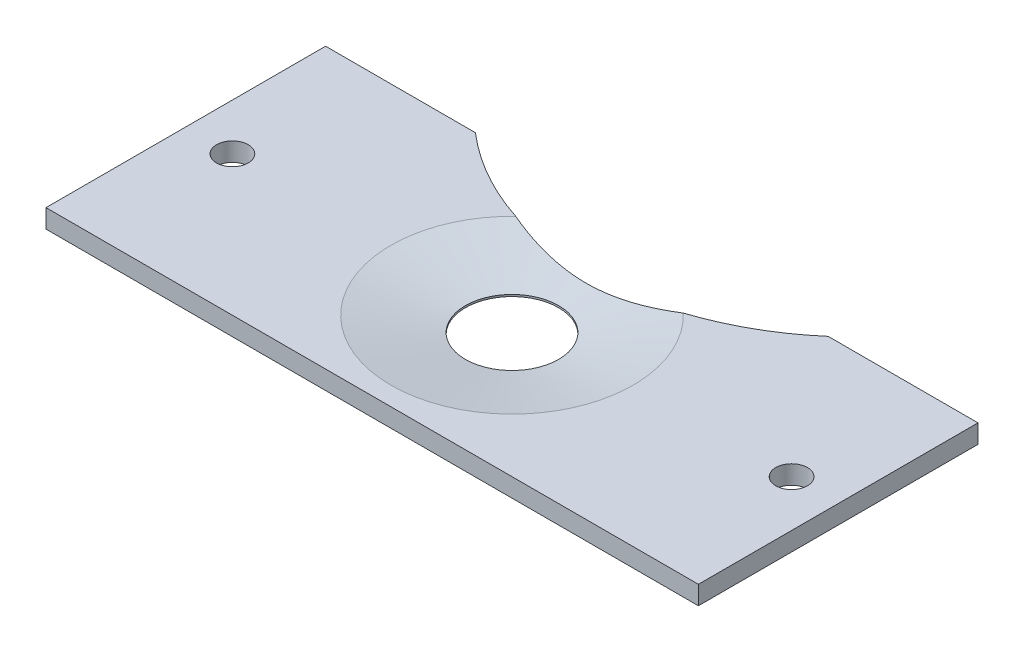
ISO-10303-21;
HEADER;
FILE_DESCRIPTION(('STEP AP214'),'2;1');
FILE_NAME('part.step','',(''),(''),'','','');
FILE_SCHEMA(('AUTOMOTIVE_DESIGN { 1 0 10303 214 1 1 1 1 }'));
ENDSEC;
DATA;
#1=APPLICATION_CONTEXT('core data for automotive mechanical design processes');
#2=APPLICATION_PROTOCOL_DEFINITION('international standard','automotive_design',2000,#1);
#3=PRODUCT_CONTEXT('',#1,'mechanical');
#4=PRODUCT('Part','Part','',(#3));
#5=PRODUCT_RELATED_PRODUCT_CATEGORY('part','',(#4));
#6=PRODUCT_DEFINITION_FORMATION('','',#4);
#7=PRODUCT_DEFINITION_CONTEXT('part definition',#1,'design');
#8=PRODUCT_DEFINITION('design','',#6,#7);
#9=PRODUCT_DEFINITION_SHAPE('','',#8);
#10=(LENGTH_UNIT() NAMED_UNIT(*) SI_UNIT(.MILLI.,.METRE.));
#11=(NAMED_UNIT(*) PLANE_ANGLE_UNIT() SI_UNIT($,.RADIAN.));
#12=(NAMED_UNIT(*) SI_UNIT($,.STERADIAN.) SOLID_ANGLE_UNIT());
#13=UNCERTAINTY_MEASURE_WITH_UNIT(LENGTH_MEASURE(1.E-05),#10,'distance_accuracy_value','');
#14=(GEOMETRIC_REPRESENTATION_CONTEXT(3) GLOBAL_UNCERTAINTY_ASSIGNED_CONTEXT((#13)) GLOBAL_UNIT_ASSIGNED_CONTEXT((#10,
#11,#12)) REPRESENTATION_CONTEXT('',''));
#15=CARTESIAN_POINT('',(0.,0.,0.));
#16=DIRECTION('',(0.,0.,1.));
#17=DIRECTION('',(1.,0.,0.));
#18=AXIS2_PLACEMENT_3D('',#15,#16,#17);
#19=CARTESIAN_POINT('',(-35.,2.,-15.));
#20=DIRECTION('',(0.,0.,1.));
#21=DIRECTION('',(1.,0.,0.));
#22=AXIS2_PLACEMENT_3D('',#19,#20,#21);
#23=PLANE('',#22);
#24=DIRECTION('',(-1.,0.,0.));
#25=VECTOR('',#24,1.);
#26=CARTESIAN_POINT('',(-35.,0.,-15.));
#27=LINE('',#26,#25);
#28=CARTESIAN_POINT('',(35.,0.,-15.));
#29=VERTEX_POINT('',#28);
#30=CARTESIAN_POINT('',(18.9251595149534,0.,-15.));
#31=VERTEX_POINT('',#30);
#32=EDGE_CURVE('E138',#29,#31,#27,.T.);
#33=ORIENTED_EDGE('',*,*,#32,.T.);
#34=DIRECTION('',(0.,1.,0.));
#35=VECTOR('',#34,1.);
#36=CARTESIAN_POINT('',(18.9251595149534,0.,-15.));
#37=LINE('',#36,#35);
#38=CARTESIAN_POINT('',(18.9251595149534,2.,-15.));
#39=VERTEX_POINT('',#38);
#40=EDGE_CURVE('E175',#31,#39,#37,.T.);
#41=ORIENTED_EDGE('',*,*,#40,.T.);
#42=DIRECTION('',(-1.,0.,0.));
#43=VECTOR('',#42,1.);
#44=CARTESIAN_POINT('',(-35.,2.,-15.));
#45=LINE('',#44,#43);
#46=CARTESIAN_POINT('',(35.,2.,-15.));
#47=VERTEX_POINT('',#46);
#48=EDGE_CURVE('E104',#47,#39,#45,.T.);
#49=ORIENTED_EDGE('',*,*,#48,.F.);
#50=DIRECTION('',(0.,-1.,0.));
#51=VECTOR('',#50,1.);
#52=CARTESIAN_POINT('',(35.,2.,-15.));
#53=LINE('',#52,#51);
#54=EDGE_CURVE('E151',#47,#29,#53,.T.);
#55=ORIENTED_EDGE('',*,*,#54,.T.);
#56=EDGE_LOOP('',(#33,#41,#49,#55));
#57=FACE_BOUND('',#56,.T.);
#58=ADVANCED_FACE('F32',(#57),#23,.F.);
#59=CARTESIAN_POINT('',(0.,2.,0.));
#60=DIRECTION('',(0.,-1.,0.));
#61=DIRECTION('',(0.,0.,-1.));
#62=AXIS2_PLACEMENT_3D('',#59,#60,#61);
#63=CYLINDRICAL_SURFACE('',#62,5.);
#64=CARTESIAN_POINT('',(0.,0.399999999999999,0.));
#65=DIRECTION('',(0.,1.,0.));
#66=DIRECTION('',(0.,0.,1.));
#67=AXIS2_PLACEMENT_3D('',#64,#65,#66);
#68=CIRCLE('',#67,5.);
#69=CARTESIAN_POINT('',(0.,0.399999999999999,5.));
#70=VERTEX_POINT('',#69);
#71=EDGE_CURVE('E109',#70,#70,#68,.T.);
#72=ORIENTED_EDGE('',*,*,#71,.T.);
#73=EDGE_LOOP('',(#72));
#74=FACE_BOUND('',#73,.T.);
#75=CARTESIAN_POINT('',(0.,0.2,0.));
#76=DIRECTION('',(0.,-1.,0.));
#77=DIRECTION('',(0.,0.,-1.));
#78=AXIS2_PLACEMENT_3D('',#75,#76,#77);
#79=CIRCLE('',#78,5.);
#80=CARTESIAN_POINT('',(0.,0.2,-5.));
#81=VERTEX_POINT('',#80);
#82=EDGE_CURVE('E115',#81,#81,#79,.T.);
#83=ORIENTED_EDGE('',*,*,#82,.T.);
#84=EDGE_LOOP('',(#83));
#85=FACE_BOUND('',#84,.T.);
#86=ADVANCED_FACE('F204',(#74,#85),#63,.F.);
#87=CARTESIAN_POINT('',(-35.,2.,15.));
#88=DIRECTION('',(0.,1.,0.));
#89=DIRECTION('',(0.,0.,1.));
#90=AXIS2_PLACEMENT_3D('',#87,#88,#89);
#91=PLANE('',#90);
#92=CARTESIAN_POINT('',(0.,2.,-36.9329032395456));
#93=DIRECTION('',(0.,1.,0.));
#94=DIRECTION('',(0.,0.,1.));
#95=AXIS2_PLACEMENT_3D('',#92,#93,#94);
#96=CIRCLE('',#95,28.9691889286135);
#97=CARTESIAN_POINT('',(8.98724404355307,2.,-9.39305299152641));
#98=VERTEX_POINT('',#97);
#99=EDGE_CURVE('E95',#98,#39,#96,.T.);
#100=ORIENTED_EDGE('',*,*,#99,.F.);
#101=CARTESIAN_POINT('',(0.,2.,0.));
#102=DIRECTION('',(0.,1.,0.));
#103=DIRECTION('',(0.,0.,1.));
#104=AXIS2_PLACEMENT_3D('',#101,#102,#103);
#105=CIRCLE('',#104,13.0000000000001);
#106=CARTESIAN_POINT('',(-8.98724404355307,2.,-9.39305299152641));
#107=VERTEX_POINT('',#106);
#108=EDGE_CURVE('E45',#98,#107,#105,.F.);
#109=ORIENTED_EDGE('',*,*,#108,.T.);
#110=CARTESIAN_POINT('',(-18.9251595149534,2.,-15.));
#111=VERTEX_POINT('',#110);
#112=EDGE_CURVE('E51',#111,#107,#96,.T.);
#113=ORIENTED_EDGE('',*,*,#112,.F.);
#114=CARTESIAN_POINT('',(-35.,2.,-15.));
#115=VERTEX_POINT('',#114);
#116=EDGE_CURVE('E58',#111,#115,#45,.T.);
#117=ORIENTED_EDGE('',*,*,#116,.T.);
#118=DIRECTION('',(0.,0.,1.));
#119=VECTOR('',#118,1.);
#120=CARTESIAN_POINT('',(-35.,2.,-15.));
#121=LINE('',#120,#119);
#122=CARTESIAN_POINT('',(-35.,2.,15.));
#123=VERTEX_POINT('',#122);
#124=EDGE_CURVE('E141',#115,#123,#121,.T.);
#125=ORIENTED_EDGE('',*,*,#124,.T.);
#126=DIRECTION('',(1.,0.,0.));
#127=VECTOR('',#126,1.);
#128=CARTESIAN_POINT('',(-35.,2.,15.));
#129=LINE('',#128,#127);
#130=CARTESIAN_POINT('',(35.,2.,15.));
#131=VERTEX_POINT('',#130);
#132=EDGE_CURVE('E143',#123,#131,#129,.T.);
#133=ORIENTED_EDGE('',*,*,#132,.T.);
#134=DIRECTION('',(0.,0.,-1.));
#135=VECTOR('',#134,1.);
#136=CARTESIAN_POINT('',(35.,2.,-15.));
#137=LINE('',#136,#135);
#138=EDGE_CURVE('E145',#131,#47,#137,.T.);
#139=ORIENTED_EDGE('',*,*,#138,.T.);
#140=ORIENTED_EDGE('',*,*,#48,.T.);
#141=EDGE_LOOP('',(#100,#109,#113,#117,#125,#133,#139,#140));
#142=FACE_BOUND('',#141,.T.);
#143=CARTESIAN_POINT('',(30.,2.,0.));
#144=DIRECTION('',(0.,1.,0.));
#145=DIRECTION('',(0.,0.,1.));
#146=AXIS2_PLACEMENT_3D('',#143,#144,#145);
#147=CIRCLE('',#146,1.69999999999999);
#148=CARTESIAN_POINT('',(30.,2.,1.69999999999999));
#149=VERTEX_POINT('',#148);
#150=EDGE_CURVE('E176',#149,#149,#147,.T.);
#151=ORIENTED_EDGE('',*,*,#150,.F.);
#152=EDGE_LOOP('',(#151));
#153=FACE_BOUND('',#152,.T.);
#154=CARTESIAN_POINT('',(-30.,2.,0.));
#155=DIRECTION('',(0.,1.,0.));
#156=DIRECTION('',(0.,0.,1.));
#157=AXIS2_PLACEMENT_3D('',#154,#155,#156);
#158=CIRCLE('',#157,1.69999999999999);
#159=CARTESIAN_POINT('',(-30.,2.,1.69999999999999));
#160=VERTEX_POINT('',#159);
#161=EDGE_CURVE('E188',#160,#160,#158,.T.);
#162=ORIENTED_EDGE('',*,*,#161,.F.);
#163=EDGE_LOOP('',(#162));
#164=FACE_BOUND('',#163,.T.);
#165=ADVANCED_FACE('F101',(#142,#153,#164),#91,.T.);
#166=CARTESIAN_POINT('',(-35.,0.,15.));
#167=DIRECTION('',(0.,1.,0.));
#168=DIRECTION('',(0.,0.,1.));
#169=AXIS2_PLACEMENT_3D('',#166,#167,#168);
#170=PLANE('',#169);
#171=CARTESIAN_POINT('',(30.,0.,0.));
#172=DIRECTION('',(0.,1.,0.));
#173=DIRECTION('',(0.,0.,1.));
#174=AXIS2_PLACEMENT_3D('',#171,#172,#173);
#175=CIRCLE('',#174,1.7);
#176=CARTESIAN_POINT('',(30.,0.,1.7));
#177=VERTEX_POINT('',#176);
#178=EDGE_CURVE('E180',#177,#177,#175,.T.);
#179=ORIENTED_EDGE('',*,*,#178,.T.);
#180=EDGE_LOOP('',(#179));
#181=FACE_BOUND('',#180,.T.);
#182=CARTESIAN_POINT('',(-30.,0.,0.));
#183=DIRECTION('',(0.,1.,0.));
#184=DIRECTION('',(0.,0.,1.));
#185=AXIS2_PLACEMENT_3D('',#182,#183,#184);
#186=CIRCLE('',#185,1.7);
#187=CARTESIAN_POINT('',(-30.,0.,1.7));
#188=VERTEX_POINT('',#187);
#189=EDGE_CURVE('E130',#188,#188,#186,.T.);
#190=ORIENTED_EDGE('',*,*,#189,.T.);
#191=EDGE_LOOP('',(#190));
#192=FACE_BOUND('',#191,.T.);
#193=CARTESIAN_POINT('',(0.,0.,0.));
#194=DIRECTION('',(0.,-1.,0.));
#195=DIRECTION('',(0.,0.,-1.));
#196=AXIS2_PLACEMENT_3D('',#193,#194,#195);
#197=CIRCLE('',#196,5.5);
#198=CARTESIAN_POINT('',(0.,0.,-5.5));
#199=VERTEX_POINT('',#198);
#200=EDGE_CURVE('E125',#199,#199,#197,.T.);
#201=ORIENTED_EDGE('',*,*,#200,.F.);
#202=EDGE_LOOP('',(#201));
#203=FACE_BOUND('',#202,.T.);
#204=CARTESIAN_POINT('',(-18.9251595149534,0.,-15.));
#205=VERTEX_POINT('',#204);
#206=CARTESIAN_POINT('',(-35.,0.,-15.));
#207=VERTEX_POINT('',#206);
#208=EDGE_CURVE('E137',#205,#207,#27,.T.);
#209=ORIENTED_EDGE('',*,*,#208,.F.);
#210=CARTESIAN_POINT('',(0.,0.,-36.9329032395456));
#211=DIRECTION('',(0.,1.,0.));
#212=DIRECTION('',(0.,0.,1.));
#213=AXIS2_PLACEMENT_3D('',#210,#211,#212);
#214=CIRCLE('',#213,28.9691889286135);
#215=EDGE_CURVE('E105',#205,#31,#214,.T.);
#216=ORIENTED_EDGE('',*,*,#215,.T.);
#217=ORIENTED_EDGE('',*,*,#32,.F.);
#218=DIRECTION('',(0.,0.,-1.));
#219=VECTOR('',#218,1.);
#220=CARTESIAN_POINT('',(35.,0.,-15.));
#221=LINE('',#220,#219);
#222=CARTESIAN_POINT('',(35.,0.,15.));
#223=VERTEX_POINT('',#222);
#224=EDGE_CURVE('E135',#223,#29,#221,.T.);
#225=ORIENTED_EDGE('',*,*,#224,.F.);
#226=DIRECTION('',(1.,0.,0.));
#227=VECTOR('',#226,1.);
#228=CARTESIAN_POINT('',(-35.,0.,15.));
#229=LINE('',#228,#227);
#230=CARTESIAN_POINT('',(-35.,0.,15.));
#231=VERTEX_POINT('',#230);
#232=EDGE_CURVE('E122',#231,#223,#229,.T.);
#233=ORIENTED_EDGE('',*,*,#232,.F.);
#234=DIRECTION('',(0.,0.,1.));
#235=VECTOR('',#234,1.);
#236=CARTESIAN_POINT('',(-35.,0.,-15.));
#237=LINE('',#236,#235);
#238=EDGE_CURVE('E117',#207,#231,#237,.T.);
#239=ORIENTED_EDGE('',*,*,#238,.F.);
#240=EDGE_LOOP('',(#209,#216,#217,#225,#233,#239));
#241=FACE_BOUND('',#240,.T.);
#242=ADVANCED_FACE('F166',(#181,#192,#203,#241),#170,.F.);
#243=CARTESIAN_POINT('',(-35.,2.,-15.));
#244=DIRECTION('',(1.,0.,0.));
#245=DIRECTION('',(0.,0.,-1.));
#246=AXIS2_PLACEMENT_3D('',#243,#244,#245);
#247=PLANE('',#246);
#248=ORIENTED_EDGE('',*,*,#238,.T.);
#249=DIRECTION('',(0.,-1.,0.));
#250=VECTOR('',#249,1.);
#251=CARTESIAN_POINT('',(-35.,2.,15.));
#252=LINE('',#251,#250);
#253=EDGE_CURVE('E112',#123,#231,#252,.T.);
#254=ORIENTED_EDGE('',*,*,#253,.F.);
#255=ORIENTED_EDGE('',*,*,#124,.F.);
#256=DIRECTION('',(0.,-1.,0.));
#257=VECTOR('',#256,1.);
#258=CARTESIAN_POINT('',(-35.,2.,-15.));
#259=LINE('',#258,#257);
#260=EDGE_CURVE('E148',#115,#207,#259,.T.);
#261=ORIENTED_EDGE('',*,*,#260,.T.);
#262=EDGE_LOOP('',(#248,#254,#255,#261));
#263=FACE_BOUND('',#262,.T.);
#264=ADVANCED_FACE('F34',(#263),#247,.F.);
#265=CARTESIAN_POINT('',(-35.,2.,15.));
#266=DIRECTION('',(0.,0.,-1.));
#267=DIRECTION('',(-1.,0.,0.));
#268=AXIS2_PLACEMENT_3D('',#265,#266,#267);
#269=PLANE('',#268);
#270=ORIENTED_EDGE('',*,*,#232,.T.);
#271=DIRECTION('',(0.,-1.,0.));
#272=VECTOR('',#271,1.);
#273=CARTESIAN_POINT('',(35.,2.,15.));
#274=LINE('',#273,#272);
#275=EDGE_CURVE('E154',#131,#223,#274,.T.);
#276=ORIENTED_EDGE('',*,*,#275,.F.);
#277=ORIENTED_EDGE('',*,*,#132,.F.);
#278=ORIENTED_EDGE('',*,*,#253,.T.);
#279=EDGE_LOOP('',(#270,#276,#277,#278));
#280=FACE_BOUND('',#279,.T.);
#281=ADVANCED_FACE('F159',(#280),#269,.F.);
#282=CARTESIAN_POINT('',(35.,2.,-15.));
#283=DIRECTION('',(-1.,0.,0.));
#284=DIRECTION('',(0.,0.,1.));
#285=AXIS2_PLACEMENT_3D('',#282,#283,#284);
#286=PLANE('',#285);
#287=ORIENTED_EDGE('',*,*,#224,.T.);
#288=ORIENTED_EDGE('',*,*,#54,.F.);
#289=ORIENTED_EDGE('',*,*,#138,.F.);
#290=ORIENTED_EDGE('',*,*,#275,.T.);
#291=EDGE_LOOP('',(#287,#288,#289,#290));
#292=FACE_BOUND('',#291,.T.);
#293=ADVANCED_FACE('F172',(#292),#286,.F.);
#294=ORIENTED_EDGE('',*,*,#116,.F.);
#295=DIRECTION('',(0.,1.,0.));
#296=VECTOR('',#295,1.);
#297=CARTESIAN_POINT('',(-18.9251595149534,0.,-15.));
#298=LINE('',#297,#296);
#299=EDGE_CURVE('E177',#111,#205,#298,.F.);
#300=ORIENTED_EDGE('',*,*,#299,.T.);
#301=ORIENTED_EDGE('',*,*,#208,.T.);
#302=ORIENTED_EDGE('',*,*,#260,.F.);
#303=EDGE_LOOP('',(#294,#300,#301,#302));
#304=FACE_BOUND('',#303,.T.);
#305=ADVANCED_FACE('F216',(#304),#23,.F.);
#306=CARTESIAN_POINT('',(0.,0.399999999999999,0.));
#307=DIRECTION('',(0.,1.,0.));
#308=DIRECTION('',(0.,0.,1.));
#309=AXIS2_PLACEMENT_3D('',#306,#307,#308);
#310=CONICAL_SURFACE('',#309,5.,1.37340076694502);
#311=CARTESIAN_POINT('',(-8.98832262466787,2.0002,-9.39340499472301));
#312=CARTESIAN_POINT('',(-8.80769747023836,1.96670774923177,-9.3344527699009));
#313=CARTESIAN_POINT('',(-8.62643816394391,1.93356403415401,-9.27725970292651));
#314=CARTESIAN_POINT('',(-8.26269507248049,1.86808337129385,-9.16641394776145));
#315=CARTESIAN_POINT('',(-8.08021128451995,1.83574642535152,-9.11276126764523));
#316=CARTESIAN_POINT('',(-7.53095240965889,1.74010393672983,-8.95713659318811));
#317=CARTESIAN_POINT('',(-7.16240709132759,1.67817369771097,-8.86051013527751));
#318=CARTESIAN_POINT('',(-6.41985556851095,1.55893152323229,-8.6814313211474));
#319=CARTESIAN_POINT('',(-6.04583562231801,1.50163506653726,-8.59902550626565));
#320=CARTESIAN_POINT('',(-5.29399618955783,1.3933661615982,-8.44896824477391));
#321=CARTESIAN_POINT('',(-4.91617684835412,1.3423934723967,-8.38131623591828));
#322=CARTESIAN_POINT('',(-3.80467201430221,1.2050473354664,-8.20509495737317));
#323=CARTESIAN_POINT('',(-3.06611297614902,1.12971855195879,-8.11681487368518));
#324=CARTESIAN_POINT('',(-1.9532600178261,1.05083050838545,-8.02724418404531));
#325=CARTESIAN_POINT('',(-1.58173657673234,1.03022121976322,-8.00452981026143));
#326=CARTESIAN_POINT('',(-0.837567757721351,1.00179541038032,-7.97343169885025));
#327=CARTESIAN_POINT('',(-0.464922408481048,0.993978565368983,-7.96504759799263));
#328=CARTESIAN_POINT('',(0.287855857343547,0.991757690949185,-7.96265112269284));
#329=CARTESIAN_POINT('',(0.667990574641926,0.997622980018404,-7.96892732419583));
#330=CARTESIAN_POINT('',(1.42723890224963,1.0228218348955,-7.99639865453552));
#331=CARTESIAN_POINT('',(1.80635247772777,1.04215585442543,-8.01759428596434));
#332=CARTESIAN_POINT('',(2.94207894059524,1.11825275208696,-8.10349592168525));
#333=CARTESIAN_POINT('',(3.69596538864918,1.1931066958555,-8.19051974725858));
#334=CARTESIAN_POINT('',(4.83071051680789,1.33118984089743,-8.36662215940191));
#335=CARTESIAN_POINT('',(5.21658890583324,1.38269453604182,-8.43458171954773));
#336=CARTESIAN_POINT('',(5.9844194254853,1.49239446231903,-8.5858815810377));
#337=CARTESIAN_POINT('',(6.36637139364078,1.55058996910636,-8.66922251616421));
#338=CARTESIAN_POINT('',(7.12455972039747,1.67187751595447,-8.85077304616869));
#339=CARTESIAN_POINT('',(7.5008108111242,1.73495271394034,-8.94893252158427));
#340=CARTESIAN_POINT('',(8.06148537472948,1.83244141919181,-9.10730225778002));
#341=CARTESIAN_POINT('',(8.2477493728502,1.86541501098663,-9.16194382549073));
#342=CARTESIAN_POINT('',(8.61900322984262,1.93220478628248,-9.27491457259831));
#343=CARTESIAN_POINT('',(8.80399309203662,1.96602096758539,-9.33324374237573));
#344=CARTESIAN_POINT('',(8.98832262466788,2.0002,-9.39340499472301));
#345=B_SPLINE_CURVE_WITH_KNOTS('',3,(#311,#312,#313,#314,#315,#316,#317,#318,#319,#320,#321,
#322,#323,#324,#325,#326,#327,#328,#329,#330,#331,#332,#333,#334,#335,#336,#337,#338,#339,#340,
#341,#342,#343,#344),.UNSPECIFIED.,.F.,.F.,(4,2,2,2,2,2,2,2,2,2,2,2,2,2,2,2,4),(0.,
0.578775971443215,1.1575532628339,2.31522724181894,3.4766210181006,4.63797052765269,
6.877046570981,7.99501180537899,9.11294870222107,10.2530761638055,11.3932420347997,
13.6768947779961,14.8621966309119,16.0475473345454,17.2289752109493,17.8196218228781,
18.4102668941136),.UNSPECIFIED.);
#346=EDGE_CURVE('E11',#107,#98,#345,.T.);
#347=ORIENTED_EDGE('',*,*,#346,.F.);
#348=ORIENTED_EDGE('',*,*,#108,.F.);
#349=EDGE_LOOP('',(#347,#348));
#350=FACE_BOUND('',#349,.T.);
#351=ORIENTED_EDGE('',*,*,#71,.F.);
#352=EDGE_LOOP('',(#351));
#353=FACE_BOUND('',#352,.T.);
#354=ADVANCED_FACE('F107',(#350,#353),#310,.F.);
#355=CARTESIAN_POINT('',(0.,0.2,0.));
#356=DIRECTION('',(0.,-1.,0.));
#357=DIRECTION('',(0.,0.,-1.));
#358=AXIS2_PLACEMENT_3D('',#355,#356,#357);
#359=CYLINDRICAL_SURFACE('',#358,5.5);
#360=CARTESIAN_POINT('',(0.,0.2,0.));
#361=DIRECTION('',(0.,-1.,0.));
#362=DIRECTION('',(0.,0.,-1.));
#363=AXIS2_PLACEMENT_3D('',#360,#361,#362);
#364=CIRCLE('',#363,5.5);
#365=CARTESIAN_POINT('',(0.,0.2,-5.5));
#366=VERTEX_POINT('',#365);
#367=EDGE_CURVE('E118',#366,#366,#364,.T.);
#368=ORIENTED_EDGE('',*,*,#367,.F.);
#369=EDGE_LOOP('',(#368));
#370=FACE_BOUND('',#369,.T.);
#371=ORIENTED_EDGE('',*,*,#200,.T.);
#372=EDGE_LOOP('',(#371));
#373=FACE_BOUND('',#372,.T.);
#374=ADVANCED_FACE('F226',(#370,#373),#359,.F.);
#375=CARTESIAN_POINT('',(0.,0.2,0.));
#376=DIRECTION('',(0.,-1.,0.));
#377=DIRECTION('',(0.,0.,-1.));
#378=AXIS2_PLACEMENT_3D('',#375,#376,#377);
#379=PLANE('',#378);
#380=ORIENTED_EDGE('',*,*,#82,.F.);
#381=EDGE_LOOP('',(#380));
#382=FACE_BOUND('',#381,.T.);
#383=ORIENTED_EDGE('',*,*,#367,.T.);
#384=EDGE_LOOP('',(#383));
#385=FACE_BOUND('',#384,.T.);
#386=ADVANCED_FACE('F199',(#382,#385),#379,.T.);
#387=CARTESIAN_POINT('',(-30.,2.,0.));
#388=DIRECTION('',(0.,1.,0.));
#389=DIRECTION('',(0.,0.,1.));
#390=AXIS2_PLACEMENT_3D('',#387,#388,#389);
#391=CYLINDRICAL_SURFACE('',#390,1.69999999999999);
#392=ORIENTED_EDGE('',*,*,#189,.F.);
#393=EDGE_LOOP('',(#392));
#394=FACE_BOUND('',#393,.T.);
#395=ORIENTED_EDGE('',*,*,#161,.T.);
#396=EDGE_LOOP('',(#395));
#397=FACE_BOUND('',#396,.T.);
#398=ADVANCED_FACE('F195',(#394,#397),#391,.F.);
#399=CARTESIAN_POINT('',(30.,2.,0.));
#400=DIRECTION('',(0.,1.,0.));
#401=DIRECTION('',(0.,0.,1.));
#402=AXIS2_PLACEMENT_3D('',#399,#400,#401);
#403=CYLINDRICAL_SURFACE('',#402,1.69999999999999);
#404=ORIENTED_EDGE('',*,*,#178,.F.);
#405=EDGE_LOOP('',(#404));
#406=FACE_BOUND('',#405,.T.);
#407=ORIENTED_EDGE('',*,*,#150,.T.);
#408=EDGE_LOOP('',(#407));
#409=FACE_BOUND('',#408,.T.);
#410=ADVANCED_FACE('F198',(#406,#409),#403,.F.);
#411=CARTESIAN_POINT('',(0.,0.,-36.9329032395456));
#412=DIRECTION('',(0.,1.,0.));
#413=DIRECTION('',(0.,0.,1.));
#414=AXIS2_PLACEMENT_3D('',#411,#412,#413);
#415=CYLINDRICAL_SURFACE('',#414,28.9691889286135);
#416=ORIENTED_EDGE('',*,*,#215,.F.);
#417=ORIENTED_EDGE('',*,*,#299,.F.);
#418=ORIENTED_EDGE('',*,*,#112,.T.);
#419=ORIENTED_EDGE('',*,*,#346,.T.);
#420=ORIENTED_EDGE('',*,*,#99,.T.);
#421=ORIENTED_EDGE('',*,*,#40,.F.);
#422=EDGE_LOOP('',(#416,#417,#418,#419,#420,#421));
#423=FACE_BOUND('',#422,.T.);
#424=ADVANCED_FACE('F94',(#423),#415,.F.);
#425=CLOSED_SHELL('',(#58,#86,#165,#242,#264,#281,#293,#305,#354,#374,#386,#398,#410,#424));
#426=MANIFOLD_SOLID_BREP('B2',#425);
#427=ADVANCED_BREP_SHAPE_REPRESENTATION('',(#18,#426),#14);
#428=SHAPE_DEFINITION_REPRESENTATION(#9,#427);
ENDSEC;
END-ISO-10303-21;
